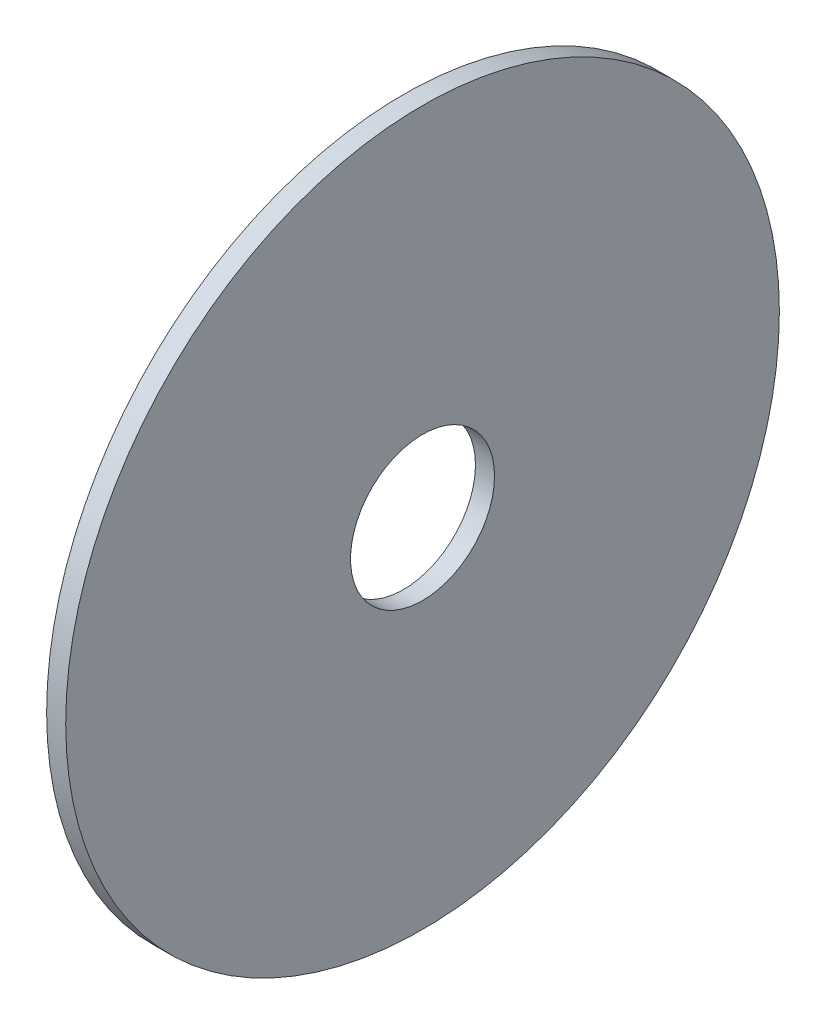
ISO-10303-21;
HEADER;
FILE_DESCRIPTION(('STEP AP214'),'2;1');
FILE_NAME('part.step','',(''),(''),'','','');
FILE_SCHEMA(('AUTOMOTIVE_DESIGN { 1 0 10303 214 1 1 1 1 }'));
ENDSEC;
DATA;
#1=APPLICATION_CONTEXT('core data for automotive mechanical design processes');
#2=APPLICATION_PROTOCOL_DEFINITION('international standard','automotive_design',2000,#1);
#3=PRODUCT_CONTEXT('',#1,'mechanical');
#4=PRODUCT('Part','Part','',(#3));
#5=PRODUCT_RELATED_PRODUCT_CATEGORY('part','',(#4));
#6=PRODUCT_DEFINITION_FORMATION('','',#4);
#7=PRODUCT_DEFINITION_CONTEXT('part definition',#1,'design');
#8=PRODUCT_DEFINITION('design','',#6,#7);
#9=PRODUCT_DEFINITION_SHAPE('','',#8);
#10=(LENGTH_UNIT() NAMED_UNIT(*) SI_UNIT(.MILLI.,.METRE.));
#11=(NAMED_UNIT(*) PLANE_ANGLE_UNIT() SI_UNIT($,.RADIAN.));
#12=(NAMED_UNIT(*) SI_UNIT($,.STERADIAN.) SOLID_ANGLE_UNIT());
#13=UNCERTAINTY_MEASURE_WITH_UNIT(LENGTH_MEASURE(1.E-05),#10,'distance_accuracy_value','');
#14=(GEOMETRIC_REPRESENTATION_CONTEXT(3) GLOBAL_UNCERTAINTY_ASSIGNED_CONTEXT((#13)) GLOBAL_UNIT_ASSIGNED_CONTEXT((#10,
#11,#12)) REPRESENTATION_CONTEXT('',''));
#15=CARTESIAN_POINT('',(0.,0.,0.));
#16=DIRECTION('',(0.,0.,1.));
#17=DIRECTION('',(1.,0.,0.));
#18=AXIS2_PLACEMENT_3D('',#15,#16,#17);
#19=CARTESIAN_POINT('',(21.,1.38777878078145E-13,-1.66533453693773E-13));
#20=DIRECTION('',(1.,0.,0.));
#21=DIRECTION('',(0.,0.,-1.));
#22=AXIS2_PLACEMENT_3D('',#19,#20,#21);
#23=CYLINDRICAL_SURFACE('',#22,74.85);
#24=CARTESIAN_POINT('',(21.,1.38777878078145E-13,-1.66533453693773E-13));
#25=DIRECTION('',(1.,0.,0.));
#26=DIRECTION('',(0.,0.,-1.));
#27=AXIS2_PLACEMENT_3D('',#24,#25,#26);
#28=CIRCLE('',#27,74.85);
#29=CARTESIAN_POINT('',(21.,1.34622868408485E-13,-74.8500000000003));
#30=VERTEX_POINT('',#29);
#31=EDGE_CURVE('E10',#30,#30,#28,.T.);
#32=ORIENTED_EDGE('',*,*,#31,.T.);
#33=EDGE_LOOP('',(#32));
#34=FACE_BOUND('',#33,.T.);
#35=CARTESIAN_POINT('',(25.,1.38777878078145E-13,-1.66533453693773E-13));
#36=DIRECTION('',(1.,0.,0.));
#37=DIRECTION('',(0.,0.,-1.));
#38=AXIS2_PLACEMENT_3D('',#35,#36,#37);
#39=CIRCLE('',#38,74.85);
#40=CARTESIAN_POINT('',(25.,1.34622868408485E-13,-74.8500000000003));
#41=VERTEX_POINT('',#40);
#42=EDGE_CURVE('E37',#41,#41,#39,.T.);
#43=ORIENTED_EDGE('',*,*,#42,.F.);
#44=EDGE_LOOP('',(#43));
#45=FACE_BOUND('',#44,.T.);
#46=ADVANCED_FACE('F34',(#34,#45),#23,.T.);
#47=CARTESIAN_POINT('',(21.,1.38777878078145E-13,-1.66533453693773E-13));
#48=DIRECTION('',(1.,0.,0.));
#49=DIRECTION('',(0.,0.,-1.));
#50=AXIS2_PLACEMENT_3D('',#47,#48,#49);
#51=PLANE('',#50);
#52=CARTESIAN_POINT('',(21.,1.38777878078145E-13,-1.66533453693773E-13));
#53=DIRECTION('',(1.,0.,0.));
#54=DIRECTION('',(0.,0.,-1.));
#55=AXIS2_PLACEMENT_3D('',#52,#53,#54);
#56=CIRCLE('',#55,15.1);
#57=CARTESIAN_POINT('',(21.,1.37939659694553E-13,-15.1000000000002));
#58=VERTEX_POINT('',#57);
#59=EDGE_CURVE('E44',#58,#58,#56,.T.);
#60=ORIENTED_EDGE('',*,*,#59,.T.);
#61=EDGE_LOOP('',(#60));
#62=FACE_BOUND('',#61,.T.);
#63=ORIENTED_EDGE('',*,*,#31,.F.);
#64=EDGE_LOOP('',(#63));
#65=FACE_BOUND('',#64,.T.);
#66=ADVANCED_FACE('F52',(#62,#65),#51,.F.);
#67=CARTESIAN_POINT('',(25.,1.38777878078145E-13,-1.66533453693773E-13));
#68=DIRECTION('',(1.,0.,0.));
#69=DIRECTION('',(0.,0.,-1.));
#70=AXIS2_PLACEMENT_3D('',#67,#68,#69);
#71=PLANE('',#70);
#72=CARTESIAN_POINT('',(25.,1.38777878078145E-13,-1.66533453693773E-13));
#73=DIRECTION('',(1.,0.,0.));
#74=DIRECTION('',(0.,0.,-1.));
#75=AXIS2_PLACEMENT_3D('',#72,#73,#74);
#76=CIRCLE('',#75,15.1);
#77=CARTESIAN_POINT('',(25.,1.37939659694553E-13,-15.1000000000002));
#78=VERTEX_POINT('',#77);
#79=EDGE_CURVE('E46',#78,#78,#76,.T.);
#80=ORIENTED_EDGE('',*,*,#79,.F.);
#81=EDGE_LOOP('',(#80));
#82=FACE_BOUND('',#81,.T.);
#83=ORIENTED_EDGE('',*,*,#42,.T.);
#84=EDGE_LOOP('',(#83));
#85=FACE_BOUND('',#84,.T.);
#86=ADVANCED_FACE('F58',(#82,#85),#71,.T.);
#87=CARTESIAN_POINT('',(21.,1.38777878078145E-13,-1.66533453693773E-13));
#88=DIRECTION('',(1.,0.,0.));
#89=DIRECTION('',(0.,0.,-1.));
#90=AXIS2_PLACEMENT_3D('',#87,#88,#89);
#91=CYLINDRICAL_SURFACE('',#90,15.1);
#92=ORIENTED_EDGE('',*,*,#59,.F.);
#93=EDGE_LOOP('',(#92));
#94=FACE_BOUND('',#93,.T.);
#95=ORIENTED_EDGE('',*,*,#79,.T.);
#96=EDGE_LOOP('',(#95));
#97=FACE_BOUND('',#96,.T.);
#98=ADVANCED_FACE('F55',(#94,#97),#91,.F.);
#99=CLOSED_SHELL('',(#46,#66,#86,#98));
#100=MANIFOLD_SOLID_BREP('B2',#99);
#101=ADVANCED_BREP_SHAPE_REPRESENTATION('',(#18,#100),#14);
#102=SHAPE_DEFINITION_REPRESENTATION(#9,#101);
ENDSEC;
END-ISO-10303-21;
